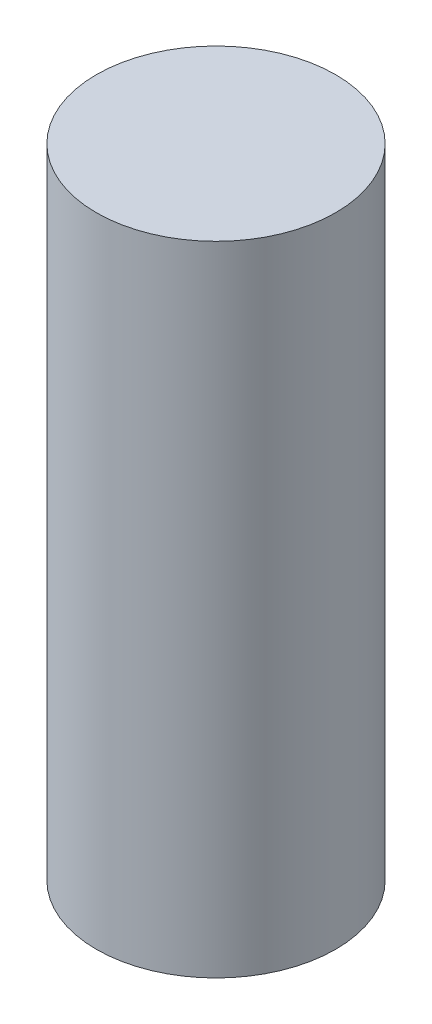
ISO-10303-21;
HEADER;
FILE_DESCRIPTION(('STEP AP214'),'2;1');
FILE_NAME('part.step','',(''),(''),'','','');
FILE_SCHEMA(('AUTOMOTIVE_DESIGN { 1 0 10303 214 1 1 1 1 }'));
ENDSEC;
DATA;
#1=APPLICATION_CONTEXT('core data for automotive mechanical design processes');
#2=APPLICATION_PROTOCOL_DEFINITION('international standard','automotive_design',2000,#1);
#3=PRODUCT_CONTEXT('',#1,'mechanical');
#4=PRODUCT('Part','Part','',(#3));
#5=PRODUCT_RELATED_PRODUCT_CATEGORY('part','',(#4));
#6=PRODUCT_DEFINITION_FORMATION('','',#4);
#7=PRODUCT_DEFINITION_CONTEXT('part definition',#1,'design');
#8=PRODUCT_DEFINITION('design','',#6,#7);
#9=PRODUCT_DEFINITION_SHAPE('','',#8);
#10=(LENGTH_UNIT() NAMED_UNIT(*) SI_UNIT(.MILLI.,.METRE.));
#11=(NAMED_UNIT(*) PLANE_ANGLE_UNIT() SI_UNIT($,.RADIAN.));
#12=(NAMED_UNIT(*) SI_UNIT($,.STERADIAN.) SOLID_ANGLE_UNIT());
#13=UNCERTAINTY_MEASURE_WITH_UNIT(LENGTH_MEASURE(1.E-05),#10,'distance_accuracy_value','');
#14=(GEOMETRIC_REPRESENTATION_CONTEXT(3) GLOBAL_UNCERTAINTY_ASSIGNED_CONTEXT((#13)) GLOBAL_UNIT_ASSIGNED_CONTEXT((#10,
#11,#12)) REPRESENTATION_CONTEXT('',''));
#15=CARTESIAN_POINT('',(0.,0.,0.));
#16=DIRECTION('',(0.,0.,1.));
#17=DIRECTION('',(1.,0.,0.));
#18=AXIS2_PLACEMENT_3D('',#15,#16,#17);
#19=CARTESIAN_POINT('',(0.,80.,0.));
#20=DIRECTION('',(0.,1.,0.));
#21=DIRECTION('',(0.,0.,1.));
#22=AXIS2_PLACEMENT_3D('',#19,#20,#21);
#23=PLANE('',#22);
#24=CARTESIAN_POINT('',(0.,80.,0.));
#25=DIRECTION('',(0.,-1.,0.));
#26=DIRECTION('',(0.,0.,-1.));
#27=AXIS2_PLACEMENT_3D('',#24,#25,#26);
#28=CIRCLE('',#27,15.);
#29=CARTESIAN_POINT('',(0.,80.,-15.));
#30=VERTEX_POINT('',#29);
#31=EDGE_CURVE('E10',#30,#30,#28,.T.);
#32=ORIENTED_EDGE('',*,*,#31,.F.);
#33=EDGE_LOOP('',(#32));
#34=FACE_BOUND('',#33,.T.);
#35=ADVANCED_FACE('F31',(#34),#23,.T.);
#36=CARTESIAN_POINT('',(0.,0.,0.));
#37=DIRECTION('',(0.,-1.,0.));
#38=DIRECTION('',(0.,0.,-1.));
#39=AXIS2_PLACEMENT_3D('',#36,#37,#38);
#40=CYLINDRICAL_SURFACE('',#39,15.);
#41=ORIENTED_EDGE('',*,*,#31,.T.);
#42=EDGE_LOOP('',(#41));
#43=FACE_BOUND('',#42,.T.);
#44=CARTESIAN_POINT('',(0.,0.,0.));
#45=DIRECTION('',(0.,-1.,0.));
#46=DIRECTION('',(0.,0.,-1.));
#47=AXIS2_PLACEMENT_3D('',#44,#45,#46);
#48=CIRCLE('',#47,15.);
#49=CARTESIAN_POINT('',(0.,0.,-15.));
#50=VERTEX_POINT('',#49);
#51=EDGE_CURVE('E37',#50,#50,#48,.T.);
#52=ORIENTED_EDGE('',*,*,#51,.F.);
#53=EDGE_LOOP('',(#52));
#54=FACE_BOUND('',#53,.T.);
#55=ADVANCED_FACE('F45',(#43,#54),#40,.T.);
#56=CARTESIAN_POINT('',(0.,0.,0.));
#57=DIRECTION('',(0.,-1.,0.));
#58=DIRECTION('',(0.,0.,-1.));
#59=AXIS2_PLACEMENT_3D('',#56,#57,#58);
#60=PLANE('',#59);
#61=ORIENTED_EDGE('',*,*,#51,.T.);
#62=EDGE_LOOP('',(#61));
#63=FACE_BOUND('',#62,.T.);
#64=ADVANCED_FACE('F43',(#63),#60,.T.);
#65=CLOSED_SHELL('',(#35,#55,#64));
#66=MANIFOLD_SOLID_BREP('B2',#65);
#67=ADVANCED_BREP_SHAPE_REPRESENTATION('',(#18,#66),#14);
#68=SHAPE_DEFINITION_REPRESENTATION(#9,#67);
ENDSEC;
END-ISO-10303-21;
